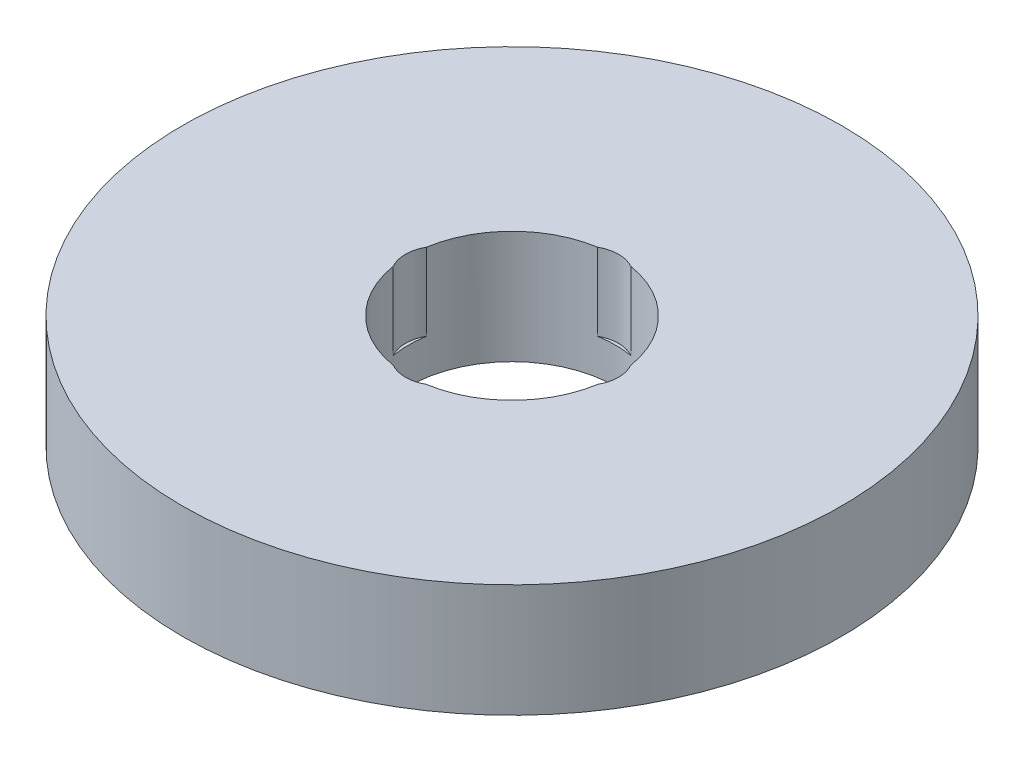
ISO-10303-21;
HEADER;
FILE_DESCRIPTION(('STEP AP214'),'2;1');
FILE_NAME('part.step','',(''),(''),'','','');
FILE_SCHEMA(('AUTOMOTIVE_DESIGN { 1 0 10303 214 1 1 1 1 }'));
ENDSEC;
DATA;
#1=APPLICATION_CONTEXT('core data for automotive mechanical design processes');
#2=APPLICATION_PROTOCOL_DEFINITION('international standard','automotive_design',2000,#1);
#3=PRODUCT_CONTEXT('',#1,'mechanical');
#4=PRODUCT('Part','Part','',(#3));
#5=PRODUCT_RELATED_PRODUCT_CATEGORY('part','',(#4));
#6=PRODUCT_DEFINITION_FORMATION('','',#4);
#7=PRODUCT_DEFINITION_CONTEXT('part definition',#1,'design');
#8=PRODUCT_DEFINITION('design','',#6,#7);
#9=PRODUCT_DEFINITION_SHAPE('','',#8);
#10=(LENGTH_UNIT() NAMED_UNIT(*) SI_UNIT(.MILLI.,.METRE.));
#11=(NAMED_UNIT(*) PLANE_ANGLE_UNIT() SI_UNIT($,.RADIAN.));
#12=(NAMED_UNIT(*) SI_UNIT($,.STERADIAN.) SOLID_ANGLE_UNIT());
#13=UNCERTAINTY_MEASURE_WITH_UNIT(LENGTH_MEASURE(1.E-05),#10,'distance_accuracy_value','');
#14=(GEOMETRIC_REPRESENTATION_CONTEXT(3) GLOBAL_UNCERTAINTY_ASSIGNED_CONTEXT((#13)) GLOBAL_UNIT_ASSIGNED_CONTEXT((#10,
#11,#12)) REPRESENTATION_CONTEXT('',''));
#15=CARTESIAN_POINT('',(0.,0.,0.));
#16=DIRECTION('',(0.,0.,1.));
#17=DIRECTION('',(1.,0.,0.));
#18=AXIS2_PLACEMENT_3D('',#15,#16,#17);
#19=CARTESIAN_POINT('',(0.,30.,0.));
#20=DIRECTION('',(0.,-1.,0.));
#21=DIRECTION('',(0.,0.,-1.));
#22=AXIS2_PLACEMENT_3D('',#19,#20,#21);
#23=CYLINDRICAL_SURFACE('',#22,87.5);
#24=CARTESIAN_POINT('',(0.,30.,0.));
#25=DIRECTION('',(0.,1.,0.));
#26=DIRECTION('',(0.,0.,1.));
#27=AXIS2_PLACEMENT_3D('',#24,#25,#26);
#28=CIRCLE('',#27,87.5);
#29=CARTESIAN_POINT('',(0.,30.,87.5));
#30=VERTEX_POINT('',#29);
#31=EDGE_CURVE('E148',#30,#30,#28,.T.);
#32=ORIENTED_EDGE('',*,*,#31,.F.);
#33=EDGE_LOOP('',(#32));
#34=FACE_BOUND('',#33,.T.);
#35=CARTESIAN_POINT('',(0.,0.,0.));
#36=DIRECTION('',(0.,1.,0.));
#37=DIRECTION('',(0.,0.,1.));
#38=AXIS2_PLACEMENT_3D('',#35,#36,#37);
#39=CIRCLE('',#38,87.5);
#40=CARTESIAN_POINT('',(0.,0.,87.5));
#41=VERTEX_POINT('',#40);
#42=EDGE_CURVE('E139',#41,#41,#39,.T.);
#43=ORIENTED_EDGE('',*,*,#42,.T.);
#44=EDGE_LOOP('',(#43));
#45=FACE_BOUND('',#44,.T.);
#46=ADVANCED_FACE('F39',(#34,#45),#23,.T.);
#47=CARTESIAN_POINT('',(0.,30.,0.));
#48=DIRECTION('',(0.,1.,0.));
#49=DIRECTION('',(0.,0.,1.));
#50=AXIS2_PLACEMENT_3D('',#47,#48,#49);
#51=PLANE('',#50);
#52=CARTESIAN_POINT('',(0.,30.,19.2291833315416));
#53=DIRECTION('',(0.,1.,0.));
#54=DIRECTION('',(1.,0.,0.));
#55=AXIS2_PLACEMENT_3D('',#52,#53,#54);
#56=CIRCLE('',#55,9.05451130679717);
#57=CARTESIAN_POINT('',(-4.39239827190214,30.,27.1469489523407));
#58=VERTEX_POINT('',#57);
#59=CARTESIAN_POINT('',(4.39239827190233,30.,27.1469489523407));
#60=VERTEX_POINT('',#59);
#61=EDGE_CURVE('E175',#58,#60,#56,.T.);
#62=ORIENTED_EDGE('',*,*,#61,.F.);
#63=CARTESIAN_POINT('',(0.,30.,0.));
#64=DIRECTION('',(0.,1.,0.));
#65=DIRECTION('',(0.,0.,1.));
#66=AXIS2_PLACEMENT_3D('',#63,#64,#65);
#67=CIRCLE('',#66,27.5);
#68=CARTESIAN_POINT('',(-27.1469489523407,30.,4.39239827190223));
#69=VERTEX_POINT('',#68);
#70=EDGE_CURVE('E134',#69,#58,#67,.T.);
#71=ORIENTED_EDGE('',*,*,#70,.F.);
#72=CARTESIAN_POINT('',(-19.2291833315416,30.,0.));
#73=DIRECTION('',(0.,1.,0.));
#74=DIRECTION('',(0.,0.,1.));
#75=AXIS2_PLACEMENT_3D('',#72,#73,#74);
#76=CIRCLE('',#75,9.05451130679717);
#77=CARTESIAN_POINT('',(-27.1469489523407,30.,-4.39239827190223));
#78=VERTEX_POINT('',#77);
#79=EDGE_CURVE('E143',#78,#69,#76,.T.);
#80=ORIENTED_EDGE('',*,*,#79,.F.);
#81=CARTESIAN_POINT('',(-4.39239827190252,30.,-27.1469489523406));
#82=VERTEX_POINT('',#81);
#83=EDGE_CURVE('E123',#82,#78,#67,.T.);
#84=ORIENTED_EDGE('',*,*,#83,.F.);
#85=CARTESIAN_POINT('',(-2.01415004289813E-13,30.,-19.2291833315416));
#86=DIRECTION('',(0.,1.,0.));
#87=DIRECTION('',(-1.,0.,0.));
#88=AXIS2_PLACEMENT_3D('',#85,#86,#87);
#89=CIRCLE('',#88,9.05451130679717);
#90=CARTESIAN_POINT('',(4.39239827190195,30.,-27.1469489523407));
#91=VERTEX_POINT('',#90);
#92=EDGE_CURVE('E106',#91,#82,#89,.T.);
#93=ORIENTED_EDGE('',*,*,#92,.F.);
#94=CARTESIAN_POINT('',(27.1469489523407,30.,-4.39239827190223));
#95=VERTEX_POINT('',#94);
#96=EDGE_CURVE('E125',#95,#91,#67,.T.);
#97=ORIENTED_EDGE('',*,*,#96,.F.);
#98=CARTESIAN_POINT('',(19.2291833315416,30.,0.));
#99=DIRECTION('',(0.,1.,0.));
#100=DIRECTION('',(0.,0.,-1.));
#101=AXIS2_PLACEMENT_3D('',#98,#99,#100);
#102=CIRCLE('',#101,9.05451130679717);
#103=CARTESIAN_POINT('',(27.1469489523407,30.,4.39239827190223));
#104=VERTEX_POINT('',#103);
#105=EDGE_CURVE('E286',#104,#95,#102,.T.);
#106=ORIENTED_EDGE('',*,*,#105,.F.);
#107=EDGE_CURVE('E135',#60,#104,#67,.T.);
#108=ORIENTED_EDGE('',*,*,#107,.F.);
#109=EDGE_LOOP('',(#62,#71,#80,#84,#93,#97,#106,#108));
#110=FACE_BOUND('',#109,.T.);
#111=ORIENTED_EDGE('',*,*,#31,.T.);
#112=EDGE_LOOP('',(#111));
#113=FACE_BOUND('',#112,.T.);
#114=ADVANCED_FACE('F118',(#110,#113),#51,.T.);
#115=CARTESIAN_POINT('',(0.,0.,0.));
#116=DIRECTION('',(0.,1.,0.));
#117=DIRECTION('',(0.,0.,1.));
#118=AXIS2_PLACEMENT_3D('',#115,#116,#117);
#119=PLANE('',#118);
#120=CARTESIAN_POINT('',(0.,0.,0.));
#121=DIRECTION('',(0.,1.,0.));
#122=DIRECTION('',(0.,0.,1.));
#123=AXIS2_PLACEMENT_3D('',#120,#121,#122);
#124=CIRCLE('',#123,27.5);
#125=CARTESIAN_POINT('',(0.,0.,27.5));
#126=VERTEX_POINT('',#125);
#127=EDGE_CURVE('E136',#126,#126,#124,.T.);
#128=ORIENTED_EDGE('',*,*,#127,.T.);
#129=EDGE_LOOP('',(#128));
#130=FACE_BOUND('',#129,.T.);
#131=ORIENTED_EDGE('',*,*,#42,.F.);
#132=EDGE_LOOP('',(#131));
#133=FACE_BOUND('',#132,.T.);
#134=ADVANCED_FACE('F187',(#130,#133),#119,.F.);
#135=CARTESIAN_POINT('',(0.,30.,0.));
#136=DIRECTION('',(0.,-1.,0.));
#137=DIRECTION('',(0.,0.,-1.));
#138=AXIS2_PLACEMENT_3D('',#135,#136,#137);
#139=CYLINDRICAL_SURFACE('',#138,27.5);
#140=DIRECTION('',(0.,1.,0.));
#141=VECTOR('',#140,1.);
#142=CARTESIAN_POINT('',(-4.39239827190215,19.7539894092849,27.1469489523407));
#143=LINE('',#142,#141);
#144=CARTESIAN_POINT('',(-4.39239827190214,9.50797881856984,27.1469489523407));
#145=VERTEX_POINT('',#144);
#146=EDGE_CURVE('E11',#145,#58,#143,.T.);
#147=ORIENTED_EDGE('',*,*,#146,.F.);
#148=CARTESIAN_POINT('',(0.,9.50797881856984,0.));
#149=DIRECTION('',(0.,1.,0.));
#150=DIRECTION('',(0.,0.,1.));
#151=AXIS2_PLACEMENT_3D('',#148,#149,#150);
#152=CIRCLE('',#151,27.5);
#153=CARTESIAN_POINT('',(4.39239827190233,9.50797881856984,27.1469489523407));
#154=VERTEX_POINT('',#153);
#155=EDGE_CURVE('E170',#145,#154,#152,.T.);
#156=ORIENTED_EDGE('',*,*,#155,.T.);
#157=DIRECTION('',(0.,1.,0.));
#158=VECTOR('',#157,1.);
#159=CARTESIAN_POINT('',(4.39239827190233,19.7539894092849,27.1469489523407));
#160=LINE('',#159,#158);
#161=EDGE_CURVE('E46',#60,#154,#160,.F.);
#162=ORIENTED_EDGE('',*,*,#161,.F.);
#163=ORIENTED_EDGE('',*,*,#107,.T.);
#164=DIRECTION('',(0.,1.,0.));
#165=VECTOR('',#164,1.);
#166=CARTESIAN_POINT('',(27.1469489523407,19.7539894092849,4.39239827190224));
#167=LINE('',#166,#165);
#168=CARTESIAN_POINT('',(27.1469489523407,9.50797881856984,4.39239827190223));
#169=VERTEX_POINT('',#168);
#170=EDGE_CURVE('E164',#169,#104,#167,.T.);
#171=ORIENTED_EDGE('',*,*,#170,.F.);
#172=CARTESIAN_POINT('',(0.,9.50797881856984,0.));
#173=DIRECTION('',(0.,1.,0.));
#174=DIRECTION('',(0.,0.,1.));
#175=AXIS2_PLACEMENT_3D('',#172,#173,#174);
#176=CIRCLE('',#175,27.5);
#177=CARTESIAN_POINT('',(27.1469489523407,9.50797881856984,-4.39239827190223));
#178=VERTEX_POINT('',#177);
#179=EDGE_CURVE('E115',#169,#178,#176,.T.);
#180=ORIENTED_EDGE('',*,*,#179,.T.);
#181=DIRECTION('',(0.,1.,0.));
#182=VECTOR('',#181,1.);
#183=CARTESIAN_POINT('',(27.1469489523407,19.7539894092849,-4.39239827190224));
#184=LINE('',#183,#182);
#185=EDGE_CURVE('E131',#95,#178,#184,.F.);
#186=ORIENTED_EDGE('',*,*,#185,.F.);
#187=ORIENTED_EDGE('',*,*,#96,.T.);
#188=DIRECTION('',(0.,1.,0.));
#189=VECTOR('',#188,1.);
#190=CARTESIAN_POINT('',(4.39239827190196,19.7539894092849,-27.1469489523407));
#191=LINE('',#190,#189);
#192=CARTESIAN_POINT('',(4.39239827190195,9.50797881856984,-27.1469489523407));
#193=VERTEX_POINT('',#192);
#194=EDGE_CURVE('E105',#193,#91,#191,.T.);
#195=ORIENTED_EDGE('',*,*,#194,.F.);
#196=CARTESIAN_POINT('',(0.,9.50797881856984,0.));
#197=DIRECTION('',(0.,1.,0.));
#198=DIRECTION('',(0.,0.,1.));
#199=AXIS2_PLACEMENT_3D('',#196,#197,#198);
#200=CIRCLE('',#199,27.5);
#201=CARTESIAN_POINT('',(-4.39239827190252,9.50797881856984,-27.1469489523406));
#202=VERTEX_POINT('',#201);
#203=EDGE_CURVE('E159',#193,#202,#200,.T.);
#204=ORIENTED_EDGE('',*,*,#203,.T.);
#205=DIRECTION('',(0.,1.,0.));
#206=VECTOR('',#205,1.);
#207=CARTESIAN_POINT('',(-4.39239827190252,19.7539894092849,-27.1469489523406));
#208=LINE('',#207,#206);
#209=EDGE_CURVE('E114',#82,#202,#208,.F.);
#210=ORIENTED_EDGE('',*,*,#209,.F.);
#211=ORIENTED_EDGE('',*,*,#83,.T.);
#212=DIRECTION('',(0.,1.,0.));
#213=VECTOR('',#212,1.);
#214=CARTESIAN_POINT('',(-27.1469489523407,19.7539894092849,-4.39239827190224));
#215=LINE('',#214,#213);
#216=CARTESIAN_POINT('',(-27.1469489523407,9.50797881856984,-4.39239827190223));
#217=VERTEX_POINT('',#216);
#218=EDGE_CURVE('E160',#217,#78,#215,.T.);
#219=ORIENTED_EDGE('',*,*,#218,.F.);
#220=CARTESIAN_POINT('',(0.,9.50797881856984,0.));
#221=DIRECTION('',(0.,1.,0.));
#222=DIRECTION('',(0.,0.,1.));
#223=AXIS2_PLACEMENT_3D('',#220,#221,#222);
#224=CIRCLE('',#223,27.5);
#225=CARTESIAN_POINT('',(-27.1469489523407,9.50797881856984,4.39239827190223));
#226=VERTEX_POINT('',#225);
#227=EDGE_CURVE('E149',#217,#226,#224,.T.);
#228=ORIENTED_EDGE('',*,*,#227,.T.);
#229=DIRECTION('',(0.,1.,0.));
#230=VECTOR('',#229,1.);
#231=CARTESIAN_POINT('',(-27.1469489523407,19.7539894092849,4.39239827190224));
#232=LINE('',#231,#230);
#233=EDGE_CURVE('E152',#69,#226,#232,.F.);
#234=ORIENTED_EDGE('',*,*,#233,.F.);
#235=ORIENTED_EDGE('',*,*,#70,.T.);
#236=EDGE_LOOP('',(#147,#156,#162,#163,#171,#180,#186,#187,#195,#204,#210,#211,#219,#228,#234,#235));
#237=FACE_BOUND('',#236,.T.);
#238=ORIENTED_EDGE('',*,*,#127,.F.);
#239=EDGE_LOOP('',(#238));
#240=FACE_BOUND('',#239,.T.);
#241=ADVANCED_FACE('F126',(#237,#240),#139,.F.);
#242=CARTESIAN_POINT('',(-19.2291833315416,9.50797881856984,0.));
#243=DIRECTION('',(0.,1.,0.));
#244=DIRECTION('',(0.,0.,1.));
#245=AXIS2_PLACEMENT_3D('',#242,#243,#244);
#246=CYLINDRICAL_SURFACE('',#245,9.05451130679717);
#247=ORIENTED_EDGE('',*,*,#218,.T.);
#248=ORIENTED_EDGE('',*,*,#79,.T.);
#249=ORIENTED_EDGE('',*,*,#233,.T.);
#250=CARTESIAN_POINT('',(-19.2291833315416,9.50797881856984,0.));
#251=DIRECTION('',(0.,1.,0.));
#252=DIRECTION('',(0.,0.,1.));
#253=AXIS2_PLACEMENT_3D('',#250,#251,#252);
#254=CIRCLE('',#253,9.05451130679717);
#255=EDGE_CURVE('E144',#217,#226,#254,.T.);
#256=ORIENTED_EDGE('',*,*,#255,.F.);
#257=EDGE_LOOP('',(#247,#248,#249,#256));
#258=FACE_BOUND('',#257,.T.);
#259=ADVANCED_FACE('F200',(#258),#246,.F.);
#260=CARTESIAN_POINT('',(-19.2291833315416,9.50797881856984,0.));
#261=DIRECTION('',(0.,1.,0.));
#262=DIRECTION('',(0.,0.,1.));
#263=AXIS2_PLACEMENT_3D('',#260,#261,#262);
#264=PLANE('',#263);
#265=ORIENTED_EDGE('',*,*,#255,.T.);
#266=ORIENTED_EDGE('',*,*,#227,.F.);
#267=EDGE_LOOP('',(#265,#266));
#268=FACE_BOUND('',#267,.T.);
#269=ADVANCED_FACE('F201',(#268),#264,.T.);
#270=CARTESIAN_POINT('',(-2.01415004289813E-13,9.50797881856984,-19.2291833315416));
#271=DIRECTION('',(0.,1.,0.));
#272=DIRECTION('',(0.,0.,1.));
#273=AXIS2_PLACEMENT_3D('',#270,#271,#272);
#274=CYLINDRICAL_SURFACE('',#273,9.05451130679717);
#275=ORIENTED_EDGE('',*,*,#194,.T.);
#276=ORIENTED_EDGE('',*,*,#92,.T.);
#277=ORIENTED_EDGE('',*,*,#209,.T.);
#278=CARTESIAN_POINT('',(-2.01415004289813E-13,9.50797881856984,-19.2291833315416));
#279=DIRECTION('',(0.,1.,0.));
#280=DIRECTION('',(-1.,0.,0.));
#281=AXIS2_PLACEMENT_3D('',#278,#279,#280);
#282=CIRCLE('',#281,9.05451130679717);
#283=EDGE_CURVE('E107',#193,#202,#282,.T.);
#284=ORIENTED_EDGE('',*,*,#283,.F.);
#285=EDGE_LOOP('',(#275,#276,#277,#284));
#286=FACE_BOUND('',#285,.T.);
#287=ADVANCED_FACE('F102',(#286),#274,.F.);
#288=CARTESIAN_POINT('',(-2.01415004289813E-13,9.50797881856984,-19.2291833315416));
#289=DIRECTION('',(0.,1.,0.));
#290=DIRECTION('',(-1.,0.,0.));
#291=AXIS2_PLACEMENT_3D('',#288,#289,#290);
#292=PLANE('',#291);
#293=ORIENTED_EDGE('',*,*,#283,.T.);
#294=ORIENTED_EDGE('',*,*,#203,.F.);
#295=EDGE_LOOP('',(#293,#294));
#296=FACE_BOUND('',#295,.T.);
#297=ADVANCED_FACE('F209',(#296),#292,.T.);
#298=CARTESIAN_POINT('',(19.2291833315416,9.50797881856984,0.));
#299=DIRECTION('',(0.,1.,0.));
#300=DIRECTION('',(0.,0.,1.));
#301=AXIS2_PLACEMENT_3D('',#298,#299,#300);
#302=CYLINDRICAL_SURFACE('',#301,9.05451130679717);
#303=ORIENTED_EDGE('',*,*,#170,.T.);
#304=ORIENTED_EDGE('',*,*,#105,.T.);
#305=ORIENTED_EDGE('',*,*,#185,.T.);
#306=CARTESIAN_POINT('',(19.2291833315416,9.50797881856984,0.));
#307=DIRECTION('',(0.,1.,0.));
#308=DIRECTION('',(0.,0.,-1.));
#309=AXIS2_PLACEMENT_3D('',#306,#307,#308);
#310=CIRCLE('',#309,9.05451130679717);
#311=EDGE_CURVE('E56',#169,#178,#310,.T.);
#312=ORIENTED_EDGE('',*,*,#311,.F.);
#313=EDGE_LOOP('',(#303,#304,#305,#312));
#314=FACE_BOUND('',#313,.T.);
#315=ADVANCED_FACE('F213',(#314),#302,.F.);
#316=CARTESIAN_POINT('',(19.2291833315416,9.50797881856984,0.));
#317=DIRECTION('',(0.,1.,0.));
#318=DIRECTION('',(0.,0.,-1.));
#319=AXIS2_PLACEMENT_3D('',#316,#317,#318);
#320=PLANE('',#319);
#321=ORIENTED_EDGE('',*,*,#311,.T.);
#322=ORIENTED_EDGE('',*,*,#179,.F.);
#323=EDGE_LOOP('',(#321,#322));
#324=FACE_BOUND('',#323,.T.);
#325=ADVANCED_FACE('F179',(#324),#320,.T.);
#326=CARTESIAN_POINT('',(0.,9.50797881856984,19.2291833315416));
#327=DIRECTION('',(0.,1.,0.));
#328=DIRECTION('',(0.,0.,1.));
#329=AXIS2_PLACEMENT_3D('',#326,#327,#328);
#330=CYLINDRICAL_SURFACE('',#329,9.05451130679717);
#331=ORIENTED_EDGE('',*,*,#146,.T.);
#332=ORIENTED_EDGE('',*,*,#61,.T.);
#333=ORIENTED_EDGE('',*,*,#161,.T.);
#334=CARTESIAN_POINT('',(0.,9.50797881856984,19.2291833315416));
#335=DIRECTION('',(0.,1.,0.));
#336=DIRECTION('',(1.,0.,0.));
#337=AXIS2_PLACEMENT_3D('',#334,#335,#336);
#338=CIRCLE('',#337,9.05451130679717);
#339=EDGE_CURVE('E55',#145,#154,#338,.T.);
#340=ORIENTED_EDGE('',*,*,#339,.F.);
#341=EDGE_LOOP('',(#331,#332,#333,#340));
#342=FACE_BOUND('',#341,.T.);
#343=ADVANCED_FACE('F171',(#342),#330,.F.);
#344=CARTESIAN_POINT('',(0.,9.50797881856984,19.2291833315416));
#345=DIRECTION('',(0.,1.,0.));
#346=DIRECTION('',(1.,0.,0.));
#347=AXIS2_PLACEMENT_3D('',#344,#345,#346);
#348=PLANE('',#347);
#349=ORIENTED_EDGE('',*,*,#339,.T.);
#350=ORIENTED_EDGE('',*,*,#155,.F.);
#351=EDGE_LOOP('',(#349,#350));
#352=FACE_BOUND('',#351,.T.);
#353=ADVANCED_FACE('F173',(#352),#348,.T.);
#354=CLOSED_SHELL('',(#46,#114,#134,#241,#259,#269,#287,#297,#315,#325,#343,#353));
#355=MANIFOLD_SOLID_BREP('B2',#354);
#356=ADVANCED_BREP_SHAPE_REPRESENTATION('',(#18,#355),#14);
#357=SHAPE_DEFINITION_REPRESENTATION(#9,#356);
ENDSEC;
END-ISO-10303-21;
